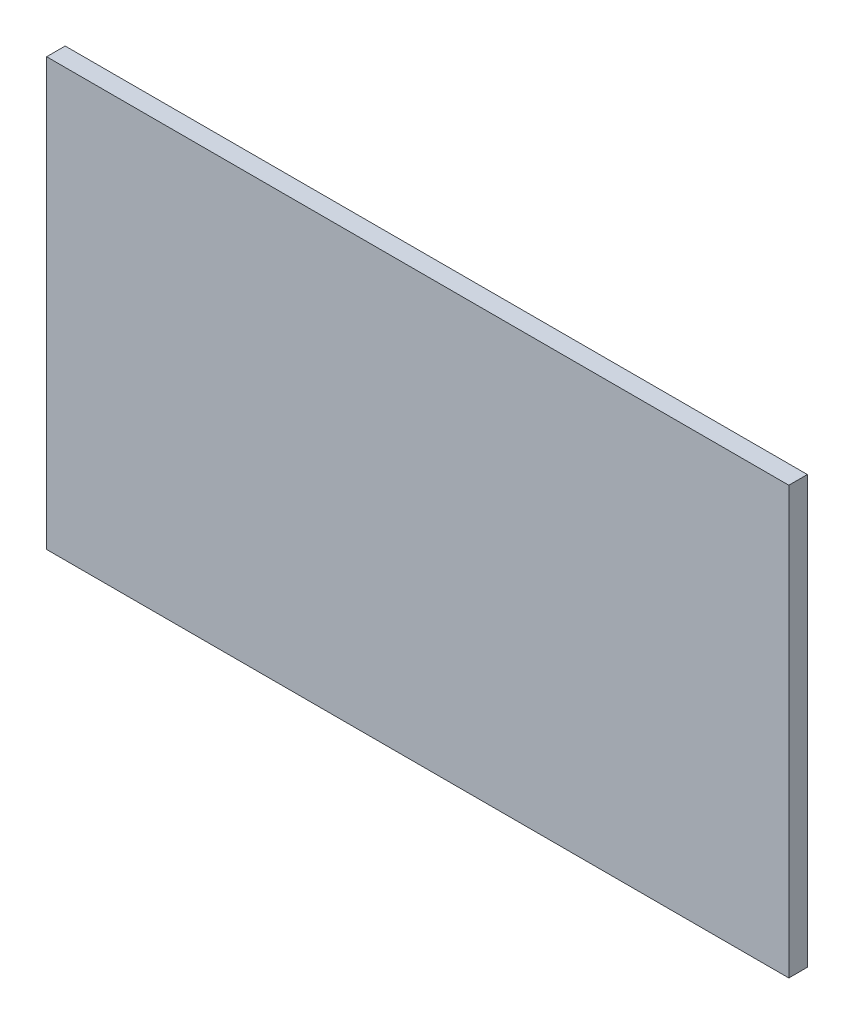
ISO-10303-21;
HEADER;
FILE_DESCRIPTION(('STEP AP214'),'2;1');
FILE_NAME('part.step','',(''),(''),'','','');
FILE_SCHEMA(('AUTOMOTIVE_DESIGN { 1 0 10303 214 1 1 1 1 }'));
ENDSEC;
DATA;
#1=APPLICATION_CONTEXT('core data for automotive mechanical design processes');
#2=APPLICATION_PROTOCOL_DEFINITION('international standard','automotive_design',2000,#1);
#3=PRODUCT_CONTEXT('',#1,'mechanical');
#4=PRODUCT('Part','Part','',(#3));
#5=PRODUCT_RELATED_PRODUCT_CATEGORY('part','',(#4));
#6=PRODUCT_DEFINITION_FORMATION('','',#4);
#7=PRODUCT_DEFINITION_CONTEXT('part definition',#1,'design');
#8=PRODUCT_DEFINITION('design','',#6,#7);
#9=PRODUCT_DEFINITION_SHAPE('','',#8);
#10=(LENGTH_UNIT() NAMED_UNIT(*) SI_UNIT(.MILLI.,.METRE.));
#11=(NAMED_UNIT(*) PLANE_ANGLE_UNIT() SI_UNIT($,.RADIAN.));
#12=(NAMED_UNIT(*) SI_UNIT($,.STERADIAN.) SOLID_ANGLE_UNIT());
#13=UNCERTAINTY_MEASURE_WITH_UNIT(LENGTH_MEASURE(1.E-05),#10,'distance_accuracy_value','');
#14=(GEOMETRIC_REPRESENTATION_CONTEXT(3) GLOBAL_UNCERTAINTY_ASSIGNED_CONTEXT((#13)) GLOBAL_UNIT_ASSIGNED_CONTEXT((#10,
#11,#12)) REPRESENTATION_CONTEXT('',''));
#15=CARTESIAN_POINT('',(0.,0.,0.));
#16=DIRECTION('',(0.,0.,1.));
#17=DIRECTION('',(1.,0.,0.));
#18=AXIS2_PLACEMENT_3D('',#15,#16,#17);
#19=CARTESIAN_POINT('',(400.,-230.,20.));
#20=DIRECTION('',(-1.,0.,0.));
#21=DIRECTION('',(0.,0.,1.));
#22=AXIS2_PLACEMENT_3D('',#19,#20,#21);
#23=PLANE('',#22);
#24=DIRECTION('',(0.,1.,0.));
#25=VECTOR('',#24,1.);
#26=CARTESIAN_POINT('',(400.,-230.,0.));
#27=LINE('',#26,#25);
#28=CARTESIAN_POINT('',(400.,-230.,0.));
#29=VERTEX_POINT('',#28);
#30=CARTESIAN_POINT('',(400.,230.,0.));
#31=VERTEX_POINT('',#30);
#32=EDGE_CURVE('E97',#29,#31,#27,.T.);
#33=ORIENTED_EDGE('',*,*,#32,.T.);
#34=DIRECTION('',(0.,0.,-1.));
#35=VECTOR('',#34,1.);
#36=CARTESIAN_POINT('',(400.,230.,20.));
#37=LINE('',#36,#35);
#38=CARTESIAN_POINT('',(400.,230.,20.));
#39=VERTEX_POINT('',#38);
#40=EDGE_CURVE('E11',#39,#31,#37,.T.);
#41=ORIENTED_EDGE('',*,*,#40,.F.);
#42=DIRECTION('',(0.,1.,0.));
#43=VECTOR('',#42,1.);
#44=CARTESIAN_POINT('',(400.,-230.,20.));
#45=LINE('',#44,#43);
#46=CARTESIAN_POINT('',(400.,-230.,20.));
#47=VERTEX_POINT('',#46);
#48=EDGE_CURVE('E85',#47,#39,#45,.T.);
#49=ORIENTED_EDGE('',*,*,#48,.F.);
#50=DIRECTION('',(0.,0.,-1.));
#51=VECTOR('',#50,1.);
#52=CARTESIAN_POINT('',(400.,-230.,20.));
#53=LINE('',#52,#51);
#54=EDGE_CURVE('E93',#47,#29,#53,.T.);
#55=ORIENTED_EDGE('',*,*,#54,.T.);
#56=EDGE_LOOP('',(#33,#41,#49,#55));
#57=FACE_BOUND('',#56,.T.);
#58=ADVANCED_FACE('F34',(#57),#23,.F.);
#59=CARTESIAN_POINT('',(-400.,230.,20.));
#60=DIRECTION('',(0.,-1.,0.));
#61=DIRECTION('',(0.,0.,-1.));
#62=AXIS2_PLACEMENT_3D('',#59,#60,#61);
#63=PLANE('',#62);
#64=DIRECTION('',(-1.,0.,0.));
#65=VECTOR('',#64,1.);
#66=CARTESIAN_POINT('',(-400.,230.,0.));
#67=LINE('',#66,#65);
#68=CARTESIAN_POINT('',(-400.,230.,0.));
#69=VERTEX_POINT('',#68);
#70=EDGE_CURVE('E89',#31,#69,#67,.T.);
#71=ORIENTED_EDGE('',*,*,#70,.T.);
#72=DIRECTION('',(0.,0.,-1.));
#73=VECTOR('',#72,1.);
#74=CARTESIAN_POINT('',(-400.,230.,20.));
#75=LINE('',#74,#73);
#76=CARTESIAN_POINT('',(-400.,230.,20.));
#77=VERTEX_POINT('',#76);
#78=EDGE_CURVE('E42',#77,#69,#75,.T.);
#79=ORIENTED_EDGE('',*,*,#78,.F.);
#80=DIRECTION('',(-1.,0.,0.));
#81=VECTOR('',#80,1.);
#82=CARTESIAN_POINT('',(-400.,230.,20.));
#83=LINE('',#82,#81);
#84=EDGE_CURVE('E80',#39,#77,#83,.T.);
#85=ORIENTED_EDGE('',*,*,#84,.F.);
#86=ORIENTED_EDGE('',*,*,#40,.T.);
#87=EDGE_LOOP('',(#71,#79,#85,#86));
#88=FACE_BOUND('',#87,.T.);
#89=ADVANCED_FACE('F88',(#88),#63,.F.);
#90=CARTESIAN_POINT('',(-400.,-230.,20.));
#91=DIRECTION('',(1.,0.,0.));
#92=DIRECTION('',(0.,0.,-1.));
#93=AXIS2_PLACEMENT_3D('',#90,#91,#92);
#94=PLANE('',#93);
#95=DIRECTION('',(0.,-1.,0.));
#96=VECTOR('',#95,1.);
#97=CARTESIAN_POINT('',(-400.,-230.,0.));
#98=LINE('',#97,#96);
#99=CARTESIAN_POINT('',(-400.,-230.,0.));
#100=VERTEX_POINT('',#99);
#101=EDGE_CURVE('E67',#69,#100,#98,.T.);
#102=ORIENTED_EDGE('',*,*,#101,.T.);
#103=DIRECTION('',(0.,0.,-1.));
#104=VECTOR('',#103,1.);
#105=CARTESIAN_POINT('',(-400.,-230.,20.));
#106=LINE('',#105,#104);
#107=CARTESIAN_POINT('',(-400.,-230.,20.));
#108=VERTEX_POINT('',#107);
#109=EDGE_CURVE('E90',#108,#100,#106,.T.);
#110=ORIENTED_EDGE('',*,*,#109,.F.);
#111=DIRECTION('',(0.,-1.,0.));
#112=VECTOR('',#111,1.);
#113=CARTESIAN_POINT('',(-400.,-230.,20.));
#114=LINE('',#113,#112);
#115=EDGE_CURVE('E83',#77,#108,#114,.T.);
#116=ORIENTED_EDGE('',*,*,#115,.F.);
#117=ORIENTED_EDGE('',*,*,#78,.T.);
#118=EDGE_LOOP('',(#102,#110,#116,#117));
#119=FACE_BOUND('',#118,.T.);
#120=ADVANCED_FACE('F91',(#119),#94,.F.);
#121=CARTESIAN_POINT('',(-400.,-230.,20.));
#122=DIRECTION('',(0.,1.,0.));
#123=DIRECTION('',(0.,0.,1.));
#124=AXIS2_PLACEMENT_3D('',#121,#122,#123);
#125=PLANE('',#124);
#126=DIRECTION('',(1.,0.,0.));
#127=VECTOR('',#126,1.);
#128=CARTESIAN_POINT('',(-400.,-230.,0.));
#129=LINE('',#128,#127);
#130=EDGE_CURVE('E73',#100,#29,#129,.T.);
#131=ORIENTED_EDGE('',*,*,#130,.T.);
#132=ORIENTED_EDGE('',*,*,#54,.F.);
#133=DIRECTION('',(1.,0.,0.));
#134=VECTOR('',#133,1.);
#135=CARTESIAN_POINT('',(-400.,-230.,20.));
#136=LINE('',#135,#134);
#137=EDGE_CURVE('E50',#108,#47,#136,.T.);
#138=ORIENTED_EDGE('',*,*,#137,.F.);
#139=ORIENTED_EDGE('',*,*,#109,.T.);
#140=EDGE_LOOP('',(#131,#132,#138,#139));
#141=FACE_BOUND('',#140,.T.);
#142=ADVANCED_FACE('F104',(#141),#125,.F.);
#143=CARTESIAN_POINT('',(0.,0.,20.));
#144=DIRECTION('',(0.,0.,-1.));
#145=DIRECTION('',(-1.,0.,0.));
#146=AXIS2_PLACEMENT_3D('',#143,#144,#145);
#147=PLANE('',#146);
#148=ORIENTED_EDGE('',*,*,#48,.T.);
#149=ORIENTED_EDGE('',*,*,#84,.T.);
#150=ORIENTED_EDGE('',*,*,#115,.T.);
#151=ORIENTED_EDGE('',*,*,#137,.T.);
#152=EDGE_LOOP('',(#148,#149,#150,#151));
#153=FACE_BOUND('',#152,.T.);
#154=ADVANCED_FACE('F81',(#153),#147,.F.);
#155=CARTESIAN_POINT('',(0.,0.,0.));
#156=DIRECTION('',(0.,0.,-1.));
#157=DIRECTION('',(-1.,0.,0.));
#158=AXIS2_PLACEMENT_3D('',#155,#156,#157);
#159=PLANE('',#158);
#160=ORIENTED_EDGE('',*,*,#32,.F.);
#161=ORIENTED_EDGE('',*,*,#130,.F.);
#162=ORIENTED_EDGE('',*,*,#101,.F.);
#163=ORIENTED_EDGE('',*,*,#70,.F.);
#164=EDGE_LOOP('',(#160,#161,#162,#163));
#165=FACE_BOUND('',#164,.T.);
#166=ADVANCED_FACE('F107',(#165),#159,.T.);
#167=CLOSED_SHELL('',(#58,#89,#120,#142,#154,#166));
#168=MANIFOLD_SOLID_BREP('B2',#167);
#169=ADVANCED_BREP_SHAPE_REPRESENTATION('',(#18,#168),#14);
#170=SHAPE_DEFINITION_REPRESENTATION(#9,#169);
ENDSEC;
END-ISO-10303-21;
